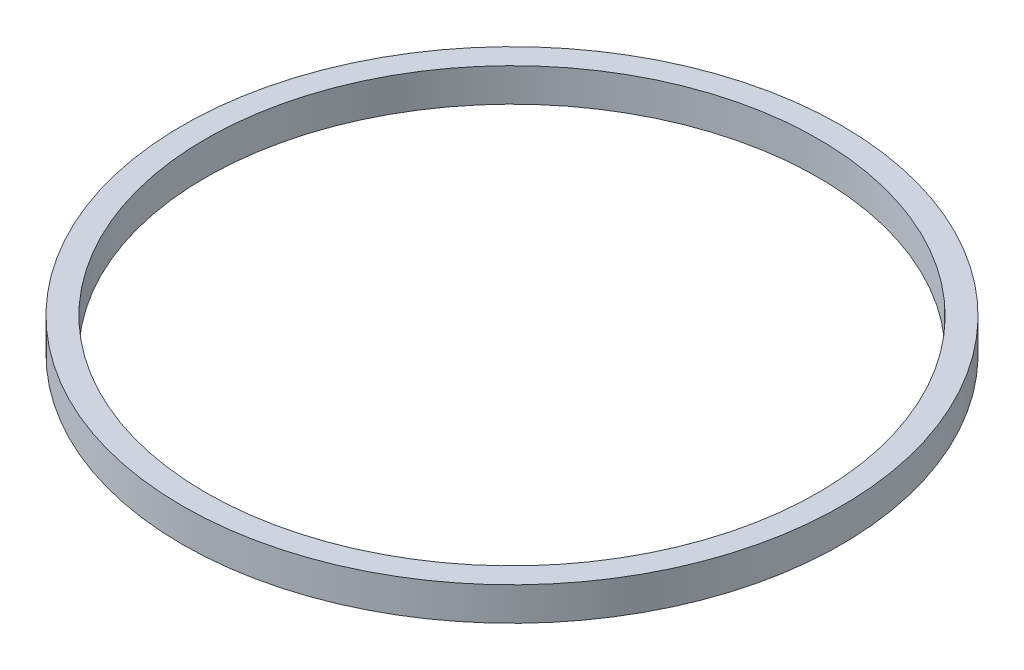
ISO-10303-21;
HEADER;
FILE_DESCRIPTION(('STEP AP214'),'2;1');
FILE_NAME('part.step','',(''),(''),'','','');
FILE_SCHEMA(('AUTOMOTIVE_DESIGN { 1 0 10303 214 1 1 1 1 }'));
ENDSEC;
DATA;
#1=APPLICATION_CONTEXT('core data for automotive mechanical design processes');
#2=APPLICATION_PROTOCOL_DEFINITION('international standard','automotive_design',2000,#1);
#3=PRODUCT_CONTEXT('',#1,'mechanical');
#4=PRODUCT('Part','Part','',(#3));
#5=PRODUCT_RELATED_PRODUCT_CATEGORY('part','',(#4));
#6=PRODUCT_DEFINITION_FORMATION('','',#4);
#7=PRODUCT_DEFINITION_CONTEXT('part definition',#1,'design');
#8=PRODUCT_DEFINITION('design','',#6,#7);
#9=PRODUCT_DEFINITION_SHAPE('','',#8);
#10=(LENGTH_UNIT() NAMED_UNIT(*) SI_UNIT(.MILLI.,.METRE.));
#11=(NAMED_UNIT(*) PLANE_ANGLE_UNIT() SI_UNIT($,.RADIAN.));
#12=(NAMED_UNIT(*) SI_UNIT($,.STERADIAN.) SOLID_ANGLE_UNIT());
#13=UNCERTAINTY_MEASURE_WITH_UNIT(LENGTH_MEASURE(1.E-05),#10,'distance_accuracy_value','');
#14=(GEOMETRIC_REPRESENTATION_CONTEXT(3) GLOBAL_UNCERTAINTY_ASSIGNED_CONTEXT((#13)) GLOBAL_UNIT_ASSIGNED_CONTEXT((#10,
#11,#12)) REPRESENTATION_CONTEXT('',''));
#15=CARTESIAN_POINT('',(0.,0.,0.));
#16=DIRECTION('',(0.,0.,1.));
#17=DIRECTION('',(1.,0.,0.));
#18=AXIS2_PLACEMENT_3D('',#15,#16,#17);
#19=CARTESIAN_POINT('',(0.,109.22,0.));
#20=DIRECTION('',(0.,1.,0.));
#21=DIRECTION('',(0.,0.,1.));
#22=AXIS2_PLACEMENT_3D('',#19,#20,#21);
#23=PLANE('',#22);
#24=CARTESIAN_POINT('',(0.,109.22,0.));
#25=DIRECTION('',(0.,1.,0.));
#26=DIRECTION('',(0.,0.,1.));
#27=AXIS2_PLACEMENT_3D('',#24,#25,#26);
#28=CIRCLE('',#27,1079.5);
#29=CARTESIAN_POINT('',(0.,109.22,1079.5));
#30=VERTEX_POINT('',#29);
#31=EDGE_CURVE('E10',#30,#30,#28,.T.);
#32=ORIENTED_EDGE('',*,*,#31,.T.);
#33=EDGE_LOOP('',(#32));
#34=FACE_BOUND('',#33,.T.);
#35=CARTESIAN_POINT('',(0.,109.22,0.));
#36=DIRECTION('',(0.,1.,0.));
#37=DIRECTION('',(0.,0.,1.));
#38=AXIS2_PLACEMENT_3D('',#35,#36,#37);
#39=CIRCLE('',#38,1003.3);
#40=CARTESIAN_POINT('',(0.,109.22,1003.3));
#41=VERTEX_POINT('',#40);
#42=EDGE_CURVE('E54',#41,#41,#39,.T.);
#43=ORIENTED_EDGE('',*,*,#42,.F.);
#44=EDGE_LOOP('',(#43));
#45=FACE_BOUND('',#44,.T.);
#46=ADVANCED_FACE('F41',(#34,#45),#23,.T.);
#47=CARTESIAN_POINT('',(0.,0.,0.));
#48=DIRECTION('',(0.,1.,0.));
#49=DIRECTION('',(0.,0.,1.));
#50=AXIS2_PLACEMENT_3D('',#47,#48,#49);
#51=PLANE('',#50);
#52=CARTESIAN_POINT('',(0.,0.,0.));
#53=DIRECTION('',(0.,1.,0.));
#54=DIRECTION('',(0.,0.,1.));
#55=AXIS2_PLACEMENT_3D('',#52,#53,#54);
#56=CIRCLE('',#55,1079.5);
#57=CARTESIAN_POINT('',(0.,0.,1079.5));
#58=VERTEX_POINT('',#57);
#59=EDGE_CURVE('E45',#58,#58,#56,.T.);
#60=ORIENTED_EDGE('',*,*,#59,.F.);
#61=EDGE_LOOP('',(#60));
#62=FACE_BOUND('',#61,.T.);
#63=CARTESIAN_POINT('',(0.,0.,0.));
#64=DIRECTION('',(0.,1.,0.));
#65=DIRECTION('',(0.,0.,1.));
#66=AXIS2_PLACEMENT_3D('',#63,#64,#65);
#67=CIRCLE('',#66,1003.3);
#68=CARTESIAN_POINT('',(0.,0.,1003.3));
#69=VERTEX_POINT('',#68);
#70=EDGE_CURVE('E56',#69,#69,#67,.T.);
#71=ORIENTED_EDGE('',*,*,#70,.T.);
#72=EDGE_LOOP('',(#71));
#73=FACE_BOUND('',#72,.T.);
#74=ADVANCED_FACE('F68',(#62,#73),#51,.F.);
#75=CARTESIAN_POINT('',(0.,109.22,0.));
#76=DIRECTION('',(0.,-1.,0.));
#77=DIRECTION('',(0.,0.,-1.));
#78=AXIS2_PLACEMENT_3D('',#75,#76,#77);
#79=CYLINDRICAL_SURFACE('',#78,1079.5);
#80=ORIENTED_EDGE('',*,*,#31,.F.);
#81=EDGE_LOOP('',(#80));
#82=FACE_BOUND('',#81,.T.);
#83=ORIENTED_EDGE('',*,*,#59,.T.);
#84=EDGE_LOOP('',(#83));
#85=FACE_BOUND('',#84,.T.);
#86=ADVANCED_FACE('F43',(#82,#85),#79,.T.);
#87=CARTESIAN_POINT('',(0.,109.22,0.));
#88=DIRECTION('',(0.,-1.,0.));
#89=DIRECTION('',(0.,0.,-1.));
#90=AXIS2_PLACEMENT_3D('',#87,#88,#89);
#91=CYLINDRICAL_SURFACE('',#90,1003.3);
#92=ORIENTED_EDGE('',*,*,#42,.T.);
#93=EDGE_LOOP('',(#92));
#94=FACE_BOUND('',#93,.T.);
#95=ORIENTED_EDGE('',*,*,#70,.F.);
#96=EDGE_LOOP('',(#95));
#97=FACE_BOUND('',#96,.T.);
#98=ADVANCED_FACE('F64',(#94,#97),#91,.F.);
#99=CLOSED_SHELL('',(#46,#74,#86,#98));
#100=MANIFOLD_SOLID_BREP('B2',#99);
#101=ADVANCED_BREP_SHAPE_REPRESENTATION('',(#18,#100),#14);
#102=SHAPE_DEFINITION_REPRESENTATION(#9,#101);
ENDSEC;
END-ISO-10303-21;
